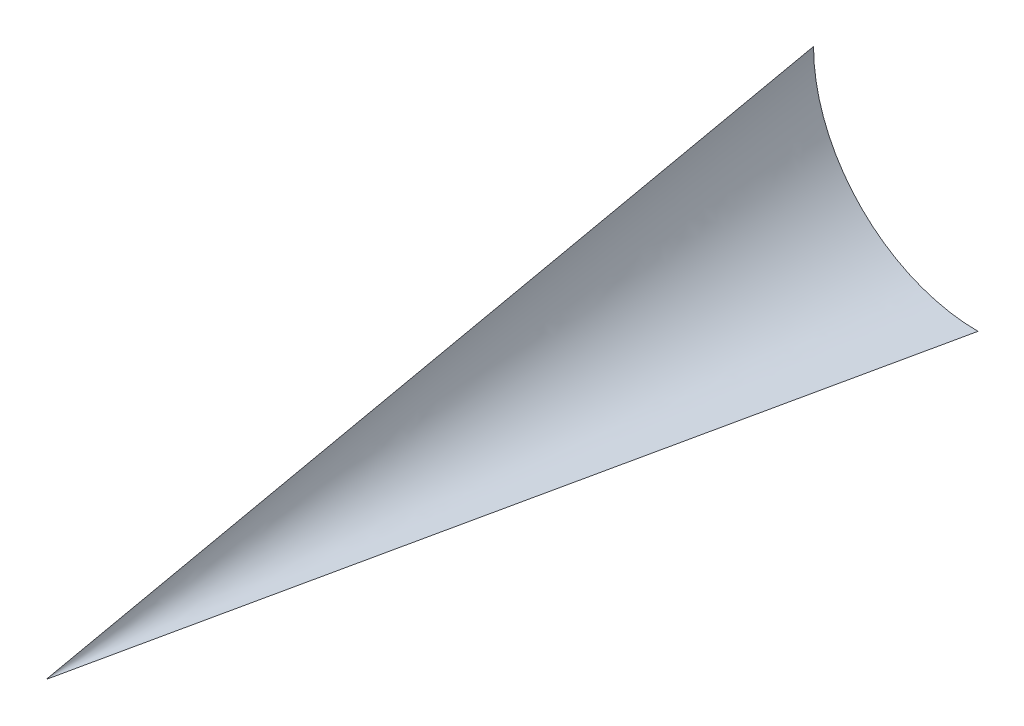
ISO-10303-21;
HEADER;
FILE_DESCRIPTION(('STEP AP214'),'2;1');
FILE_NAME('part.step','',(''),(''),'','','');
FILE_SCHEMA(('AUTOMOTIVE_DESIGN { 1 0 10303 214 1 1 1 1 }'));
ENDSEC;
DATA;
#1=APPLICATION_CONTEXT('core data for automotive mechanical design processes');
#2=APPLICATION_PROTOCOL_DEFINITION('international standard','automotive_design',2000,#1);
#3=PRODUCT_CONTEXT('',#1,'mechanical');
#4=PRODUCT('Part','Part','',(#3));
#5=PRODUCT_RELATED_PRODUCT_CATEGORY('part','',(#4));
#6=PRODUCT_DEFINITION_FORMATION('','',#4);
#7=PRODUCT_DEFINITION_CONTEXT('part definition',#1,'design');
#8=PRODUCT_DEFINITION('design','',#6,#7);
#9=PRODUCT_DEFINITION_SHAPE('','',#8);
#10=(LENGTH_UNIT() NAMED_UNIT(*) SI_UNIT(.MILLI.,.METRE.));
#11=(NAMED_UNIT(*) PLANE_ANGLE_UNIT() SI_UNIT($,.RADIAN.));
#12=(NAMED_UNIT(*) SI_UNIT($,.STERADIAN.) SOLID_ANGLE_UNIT());
#13=UNCERTAINTY_MEASURE_WITH_UNIT(LENGTH_MEASURE(1.E-05),#10,'distance_accuracy_value','');
#14=(GEOMETRIC_REPRESENTATION_CONTEXT(3) GLOBAL_UNCERTAINTY_ASSIGNED_CONTEXT((#13)) GLOBAL_UNIT_ASSIGNED_CONTEXT((#10,
#11,#12)) REPRESENTATION_CONTEXT('',''));
#15=CARTESIAN_POINT('',(0.,0.,0.));
#16=DIRECTION('',(0.,0.,1.));
#17=DIRECTION('',(1.,0.,0.));
#18=AXIS2_PLACEMENT_3D('',#15,#16,#17);
#19=CARTESIAN_POINT('',(15.,15.,0.));
#20=DIRECTION('',(0.,0.,1.));
#21=DIRECTION('',(1.,0.,0.));
#22=AXIS2_PLACEMENT_3D('',#19,#20,#21);
#23=PLANE('',#22);
#24=CARTESIAN_POINT('',(15.,15.,0.));
#25=DIRECTION('',(0.,0.,-1.));
#26=DIRECTION('',(1.,0.,0.));
#27=AXIS2_PLACEMENT_3D('',#24,#25,#26);
#28=CIRCLE('',#27,15.);
#29=CARTESIAN_POINT('',(15.,0.,0.));
#30=VERTEX_POINT('',#29);
#31=CARTESIAN_POINT('',(0.,15.,0.));
#32=VERTEX_POINT('',#31);
#33=EDGE_CURVE('E83',#30,#32,#28,.T.);
#34=ORIENTED_EDGE('',*,*,#33,.F.);
#35=DIRECTION('',(1.,0.,0.));
#36=VECTOR('',#35,1.);
#37=CARTESIAN_POINT('',(0.,0.,0.));
#38=LINE('',#37,#36);
#39=CARTESIAN_POINT('',(0.,0.,0.));
#40=VERTEX_POINT('',#39);
#41=EDGE_CURVE('E65',#40,#30,#38,.T.);
#42=ORIENTED_EDGE('',*,*,#41,.F.);
#43=DIRECTION('',(0.,-1.,0.));
#44=VECTOR('',#43,1.);
#45=CARTESIAN_POINT('',(0.,15.,0.));
#46=LINE('',#45,#44);
#47=EDGE_CURVE('E81',#32,#40,#46,.T.);
#48=ORIENTED_EDGE('',*,*,#47,.F.);
#49=EDGE_LOOP('',(#34,#42,#48));
#50=FACE_BOUND('',#49,.T.);
#51=ADVANCED_FACE('F43',(#50),#23,.F.);
#52=CARTESIAN_POINT('',(0.,0.,0.));
#53=DIRECTION('',(-1.,0.,0.));
#54=DIRECTION('',(0.,-1.,0.));
#55=AXIS2_PLACEMENT_3D('',#52,#53,#54);
#56=PLANE('',#55);
#57=DIRECTION('',(0.,0.209529088730873,-0.97780241407741));
#58=VECTOR('',#57,1.);
#59=CARTESIAN_POINT('',(0.,0.,70.));
#60=LINE('',#59,#58);
#61=CARTESIAN_POINT('',(0.,0.,70.));
#62=VERTEX_POINT('',#61);
#63=EDGE_CURVE('E72',#62,#32,#60,.T.);
#64=ORIENTED_EDGE('',*,*,#63,.T.);
#65=ORIENTED_EDGE('',*,*,#47,.T.);
#66=DIRECTION('',(0.,0.,-1.));
#67=VECTOR('',#66,1.);
#68=CARTESIAN_POINT('',(0.,0.,70.));
#69=LINE('',#68,#67);
#70=EDGE_CURVE('E57',#62,#40,#69,.T.);
#71=ORIENTED_EDGE('',*,*,#70,.F.);
#72=EDGE_LOOP('',(#64,#65,#71));
#73=FACE_BOUND('',#72,.T.);
#74=ADVANCED_FACE('F94',(#73),#56,.T.);
#75=CARTESIAN_POINT('',(0.,0.,0.));
#76=DIRECTION('',(0.,-1.,0.));
#77=DIRECTION('',(0.,0.,-1.));
#78=AXIS2_PLACEMENT_3D('',#75,#76,#77);
#79=PLANE('',#78);
#80=ORIENTED_EDGE('',*,*,#70,.T.);
#81=ORIENTED_EDGE('',*,*,#41,.T.);
#82=DIRECTION('',(0.209529088730874,0.,-0.97780241407741));
#83=VECTOR('',#82,1.);
#84=CARTESIAN_POINT('',(7.5,0.,35.));
#85=LINE('',#84,#83);
#86=EDGE_CURVE('E12',#62,#30,#85,.T.);
#87=ORIENTED_EDGE('',*,*,#86,.F.);
#88=EDGE_LOOP('',(#80,#81,#87));
#89=FACE_BOUND('',#88,.T.);
#90=ADVANCED_FACE('F111',(#89),#79,.T.);
#91=CARTESIAN_POINT('',(0.,0.,70.));
#92=CARTESIAN_POINT('',(0.,15.,0.));
#93=CARTESIAN_POINT('',(0.,0.,70.));
#94=CARTESIAN_POINT('',(0.,14.1161165235168,0.));
#95=CARTESIAN_POINT('',(0.,0.,70.));
#96=CARTESIAN_POINT('',(0.0785752090580844,13.1991789305642,0.));
#97=CARTESIAN_POINT('',(0.,0.,70.));
#98=CARTESIAN_POINT('',(0.422263738444696,11.3419294970715,0.));
#99=CARTESIAN_POINT('',(0.,0.,70.));
#100=CARTESIAN_POINT('',(0.687678283132988,10.401806484451,0.));
#101=CARTESIAN_POINT('',(0.,0.,70.));
#102=CARTESIAN_POINT('',(1.41867268499411,8.5553522286928,0.));
#103=CARTESIAN_POINT('',(0.,0.,70.));
#104=CARTESIAN_POINT('',(1.88442501680526,7.64939525084939,0.));
#105=CARTESIAN_POINT('',(0.,0.,70.));
#106=CARTESIAN_POINT('',(3.00570964663521,5.93431214759633,0.));
#107=CARTESIAN_POINT('',(0.,0.,70.));
#108=CARTESIAN_POINT('',(3.66116523516816,5.12563132923542,0.));
#109=CARTESIAN_POINT('',(0.,0.,70.));
#110=CARTESIAN_POINT('',(5.12563132923542,3.66116523516816,0.));
#111=CARTESIAN_POINT('',(0.,0.,70.));
#112=CARTESIAN_POINT('',(5.93431214759633,3.0057096466352,0.));
#113=CARTESIAN_POINT('',(0.,0.,70.));
#114=CARTESIAN_POINT('',(7.6493952508494,1.88442501680525,0.));
#115=CARTESIAN_POINT('',(0.,0.,70.));
#116=CARTESIAN_POINT('',(8.5553522286928,1.41867268499411,0.));
#117=CARTESIAN_POINT('',(0.,0.,70.));
#118=CARTESIAN_POINT('',(10.401806484451,0.687678283132982,0.));
#119=CARTESIAN_POINT('',(0.,0.,70.));
#120=CARTESIAN_POINT('',(11.3419294970715,0.42226373844469,0.));
#121=CARTESIAN_POINT('',(0.,0.,70.));
#122=CARTESIAN_POINT('',(13.1991789305642,0.0785752090580778,0.));
#123=CARTESIAN_POINT('',(0.,0.,70.));
#124=CARTESIAN_POINT('',(14.1161165235168,0.,0.));
#125=CARTESIAN_POINT('',(0.,0.,70.));
#126=CARTESIAN_POINT('',(15.,0.,0.));
#127=B_SPLINE_SURFACE_WITH_KNOTS('',3,1,((#91,#92),(#93,#94),(#95,#96),(#97,#98),(#99,#100),
(#101,#102),(#103,#104),(#105,#106),(#107,#108),(#109,#110),(#111,#112),(#113,#114),(#115,#116),
(#117,#118),(#119,#120),(#121,#122),(#123,#124),(#125,#126)),.UNSPECIFIED.,.F.,.F.,.F.,(4,2,2,2,
2,2,2,2,4),(2,2),(0.,0.125,0.25,0.375,0.5,0.625,0.75,0.875,1.),(0.,1.),.UNSPECIFIED.);
#128=ORIENTED_EDGE('',*,*,#86,.T.);
#129=ORIENTED_EDGE('',*,*,#33,.T.);
#130=ORIENTED_EDGE('',*,*,#63,.F.);
#131=EDGE_LOOP('',(#128,#129,#130));
#132=FACE_BOUND('',#131,.T.);
#133=ADVANCED_FACE('F45',(#132),#127,.T.);
#134=CLOSED_SHELL('',(#51,#74,#90,#133));
#135=MANIFOLD_SOLID_BREP('B2',#134);
#136=ADVANCED_BREP_SHAPE_REPRESENTATION('',(#18,#135),#14);
#137=SHAPE_DEFINITION_REPRESENTATION(#9,#136);
ENDSEC;
END-ISO-10303-21;
